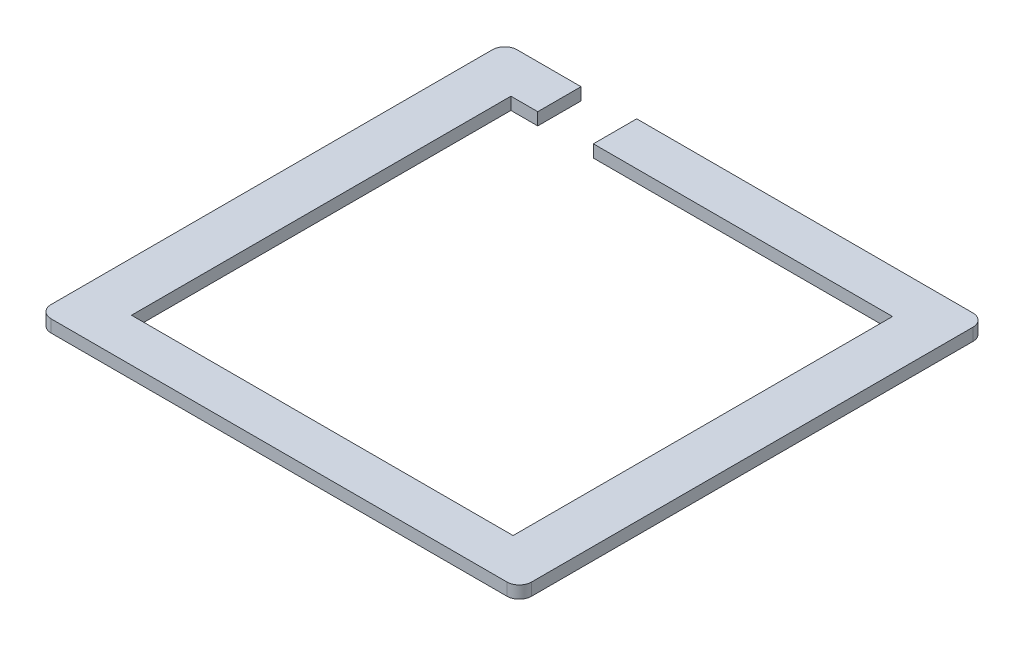
ISO-10303-21;
HEADER;
FILE_DESCRIPTION(('STEP AP214'),'2;1');
FILE_NAME('part.step','',(''),(''),'','','');
FILE_SCHEMA(('AUTOMOTIVE_DESIGN { 1 0 10303 214 1 1 1 1 }'));
ENDSEC;
DATA;
#1=APPLICATION_CONTEXT('core data for automotive mechanical design processes');
#2=APPLICATION_PROTOCOL_DEFINITION('international standard','automotive_design',2000,#1);
#3=PRODUCT_CONTEXT('',#1,'mechanical');
#4=PRODUCT('Part','Part','',(#3));
#5=PRODUCT_RELATED_PRODUCT_CATEGORY('part','',(#4));
#6=PRODUCT_DEFINITION_FORMATION('','',#4);
#7=PRODUCT_DEFINITION_CONTEXT('part definition',#1,'design');
#8=PRODUCT_DEFINITION('design','',#6,#7);
#9=PRODUCT_DEFINITION_SHAPE('','',#8);
#10=(LENGTH_UNIT() NAMED_UNIT(*) SI_UNIT(.MILLI.,.METRE.));
#11=(NAMED_UNIT(*) PLANE_ANGLE_UNIT() SI_UNIT($,.RADIAN.));
#12=(NAMED_UNIT(*) SI_UNIT($,.STERADIAN.) SOLID_ANGLE_UNIT());
#13=UNCERTAINTY_MEASURE_WITH_UNIT(LENGTH_MEASURE(1.E-05),#10,'distance_accuracy_value','');
#14=(GEOMETRIC_REPRESENTATION_CONTEXT(3) GLOBAL_UNCERTAINTY_ASSIGNED_CONTEXT((#13)) GLOBAL_UNIT_ASSIGNED_CONTEXT((#10,
#11,#12)) REPRESENTATION_CONTEXT('',''));
#15=CARTESIAN_POINT('',(0.,0.,0.));
#16=DIRECTION('',(0.,0.,1.));
#17=DIRECTION('',(1.,0.,0.));
#18=AXIS2_PLACEMENT_3D('',#15,#16,#17);
#19=CARTESIAN_POINT('',(-230.623168849227,-3016.47318900647,-84.0224827547028));
#20=DIRECTION('',(0.,0.,1.));
#21=DIRECTION('',(1.,0.,0.));
#22=AXIS2_PLACEMENT_3D('',#19,#20,#21);
#23=PLANE('',#22);
#24=DIRECTION('',(-1.,0.,0.));
#25=VECTOR('',#24,1.);
#26=CARTESIAN_POINT('',(-230.623168849227,-3016.47318900647,-84.0224827547028));
#27=LINE('',#26,#25);
#28=CARTESIAN_POINT('',(-220.284101987997,-3016.47318900647,-84.0224827547028));
#29=VERTEX_POINT('',#28);
#30=CARTESIAN_POINT('',(-230.623168849227,-3016.47318900647,-84.0224827547028));
#31=VERTEX_POINT('',#30);
#32=EDGE_CURVE('E190',#29,#31,#27,.T.);
#33=ORIENTED_EDGE('',*,*,#32,.F.);
#34=DIRECTION('',(0.,1.,0.));
#35=VECTOR('',#34,1.);
#36=CARTESIAN_POINT('',(-220.284101987997,-3018.47318900647,-84.0224827547028));
#37=LINE('',#36,#35);
#38=CARTESIAN_POINT('',(-220.284101987997,-3018.47318900647,-84.0224827547028));
#39=VERTEX_POINT('',#38);
#40=EDGE_CURVE('E263',#39,#29,#37,.T.);
#41=ORIENTED_EDGE('',*,*,#40,.F.);
#42=DIRECTION('',(-1.,0.,0.));
#43=VECTOR('',#42,1.);
#44=CARTESIAN_POINT('',(-230.623168849227,-3018.47318900647,-84.0224827547028));
#45=LINE('',#44,#43);
#46=CARTESIAN_POINT('',(-230.623168849227,-3018.47318900647,-84.0224827547028));
#47=VERTEX_POINT('',#46);
#48=EDGE_CURVE('E160',#39,#47,#45,.T.);
#49=ORIENTED_EDGE('',*,*,#48,.T.);
#50=DIRECTION('',(0.,-1.,0.));
#51=VECTOR('',#50,1.);
#52=CARTESIAN_POINT('',(-230.623168849227,-3016.47318900647,-84.0224827547028));
#53=LINE('',#52,#51);
#54=EDGE_CURVE('E41',#31,#47,#53,.T.);
#55=ORIENTED_EDGE('',*,*,#54,.F.);
#56=EDGE_LOOP('',(#33,#41,#49,#55));
#57=FACE_BOUND('',#56,.T.);
#58=ADVANCED_FACE('F33',(#57),#23,.F.);
#59=CARTESIAN_POINT('',(-224.623168849227,-3016.47318900647,-77.0224827547028));
#60=DIRECTION('',(0.,0.,1.));
#61=DIRECTION('',(1.,0.,0.));
#62=AXIS2_PLACEMENT_3D('',#59,#60,#61);
#63=PLANE('',#62);
#64=DIRECTION('',(0.,1.,0.));
#65=VECTOR('',#64,1.);
#66=CARTESIAN_POINT('',(-220.284101987998,-3018.47318900647,-77.0224827547028));
#67=LINE('',#66,#65);
#68=CARTESIAN_POINT('',(-220.284101987998,-3018.47318900647,-77.0224827547028));
#69=VERTEX_POINT('',#68);
#70=CARTESIAN_POINT('',(-220.284101987998,-3016.47318900647,-77.0224827547028));
#71=VERTEX_POINT('',#70);
#72=EDGE_CURVE('E143',#69,#71,#67,.T.);
#73=ORIENTED_EDGE('',*,*,#72,.T.);
#74=DIRECTION('',(-1.,0.,0.));
#75=VECTOR('',#74,1.);
#76=CARTESIAN_POINT('',(-224.623168849227,-3016.47318900647,-77.0224827547028));
#77=LINE('',#76,#75);
#78=CARTESIAN_POINT('',(-224.623168849227,-3016.47318900647,-77.0224827547028));
#79=VERTEX_POINT('',#78);
#80=EDGE_CURVE('E280',#71,#79,#77,.T.);
#81=ORIENTED_EDGE('',*,*,#80,.T.);
#82=DIRECTION('',(0.,-1.,0.));
#83=VECTOR('',#82,1.);
#84=CARTESIAN_POINT('',(-224.623168849227,-3016.47318900647,-77.0224827547028));
#85=LINE('',#84,#83);
#86=CARTESIAN_POINT('',(-224.623168849227,-3018.47318900647,-77.0224827547028));
#87=VERTEX_POINT('',#86);
#88=EDGE_CURVE('E166',#79,#87,#85,.T.);
#89=ORIENTED_EDGE('',*,*,#88,.T.);
#90=DIRECTION('',(-1.,0.,0.));
#91=VECTOR('',#90,1.);
#92=CARTESIAN_POINT('',(-224.623168849227,-3018.47318900647,-77.0224827547028));
#93=LINE('',#92,#91);
#94=EDGE_CURVE('E157',#69,#87,#93,.T.);
#95=ORIENTED_EDGE('',*,*,#94,.F.);
#96=EDGE_LOOP('',(#73,#81,#89,#95));
#97=FACE_BOUND('',#96,.T.);
#98=ADVANCED_FACE('F164',(#97),#63,.T.);
#99=CARTESIAN_POINT('',(-156.921026238005,-3016.47318900647,-82.0224827547028));
#100=DIRECTION('',(0.,-1.,0.));
#101=DIRECTION('',(0.,0.,-1.));
#102=AXIS2_PLACEMENT_3D('',#99,#100,#101);
#103=PLANE('',#102);
#104=ORIENTED_EDGE('',*,*,#80,.F.);
#105=DIRECTION('',(0.,0.,1.));
#106=VECTOR('',#105,1.);
#107=CARTESIAN_POINT('',(-220.284101987997,-3016.47318900647,-84.0224827547028));
#108=LINE('',#107,#106);
#109=EDGE_CURVE('E48',#29,#71,#108,.T.);
#110=ORIENTED_EDGE('',*,*,#109,.F.);
#111=ORIENTED_EDGE('',*,*,#32,.T.);
#112=CARTESIAN_POINT('',(-230.623168849227,-3016.47318900647,-82.0224827547028));
#113=DIRECTION('',(0.,1.,0.));
#114=DIRECTION('',(0.,0.,-1.));
#115=AXIS2_PLACEMENT_3D('',#112,#113,#114);
#116=CIRCLE('',#115,2.);
#117=CARTESIAN_POINT('',(-232.623168849227,-3016.47318900647,-82.0224827547028));
#118=VERTEX_POINT('',#117);
#119=EDGE_CURVE('E195',#31,#118,#116,.T.);
#120=ORIENTED_EDGE('',*,*,#119,.T.);
#121=DIRECTION('',(0.,0.,1.));
#122=VECTOR('',#121,1.);
#123=CARTESIAN_POINT('',(-232.623168849227,-3016.47318900647,-82.0224827547028));
#124=LINE('',#123,#122);
#125=CARTESIAN_POINT('',(-232.623168849227,-3016.47318900647,-10.6752428557218));
#126=VERTEX_POINT('',#125);
#127=EDGE_CURVE('E197',#118,#126,#124,.T.);
#128=ORIENTED_EDGE('',*,*,#127,.T.);
#129=CARTESIAN_POINT('',(-230.623168849227,-3016.47318900647,-10.6752428557218));
#130=DIRECTION('',(0.,1.,0.));
#131=DIRECTION('',(0.,0.,-1.));
#132=AXIS2_PLACEMENT_3D('',#129,#130,#131);
#133=CIRCLE('',#132,1.99999999999999);
#134=CARTESIAN_POINT('',(-230.623168849227,-3016.47318900647,-8.67524285572184));
#135=VERTEX_POINT('',#134);
#136=EDGE_CURVE('E199',#126,#135,#133,.T.);
#137=ORIENTED_EDGE('',*,*,#136,.T.);
#138=DIRECTION('',(1.,0.,0.));
#139=VECTOR('',#138,1.);
#140=CARTESIAN_POINT('',(-230.623168849227,-3016.47318900647,-8.67524285572183));
#141=LINE('',#140,#139);
#142=CARTESIAN_POINT('',(-156.921026238005,-3016.47318900647,-8.67524285572183));
#143=VERTEX_POINT('',#142);
#144=EDGE_CURVE('E201',#135,#143,#141,.T.);
#145=ORIENTED_EDGE('',*,*,#144,.T.);
#146=CARTESIAN_POINT('',(-156.921026238005,-3016.47318900647,-10.6752428557218));
#147=DIRECTION('',(0.,1.,0.));
#148=DIRECTION('',(0.,0.,-1.));
#149=AXIS2_PLACEMENT_3D('',#146,#147,#148);
#150=CIRCLE('',#149,1.99999999999999);
#151=CARTESIAN_POINT('',(-154.921026238005,-3016.47318900647,-10.6752428557218));
#152=VERTEX_POINT('',#151);
#153=EDGE_CURVE('E203',#143,#152,#150,.T.);
#154=ORIENTED_EDGE('',*,*,#153,.T.);
#155=DIRECTION('',(0.,0.,-1.));
#156=VECTOR('',#155,1.);
#157=CARTESIAN_POINT('',(-154.921026238005,-3016.47318900647,-82.0224827547028));
#158=LINE('',#157,#156);
#159=CARTESIAN_POINT('',(-154.921026238005,-3016.47318900647,-82.0224827547028));
#160=VERTEX_POINT('',#159);
#161=EDGE_CURVE('E205',#152,#160,#158,.T.);
#162=ORIENTED_EDGE('',*,*,#161,.T.);
#163=CARTESIAN_POINT('',(-156.921026238005,-3016.47318900647,-82.0224827547028));
#164=DIRECTION('',(0.,1.,0.));
#165=DIRECTION('',(0.,0.,-1.));
#166=AXIS2_PLACEMENT_3D('',#163,#164,#165);
#167=CIRCLE('',#166,2.);
#168=CARTESIAN_POINT('',(-156.921026238005,-3016.47318900647,-84.0224827547028));
#169=VERTEX_POINT('',#168);
#170=EDGE_CURVE('E187',#160,#169,#167,.T.);
#171=ORIENTED_EDGE('',*,*,#170,.T.);
#172=CARTESIAN_POINT('',(-211.284101987998,-3016.47318900647,-84.0224827547028));
#173=VERTEX_POINT('',#172);
#174=EDGE_CURVE('E192',#169,#173,#27,.T.);
#175=ORIENTED_EDGE('',*,*,#174,.T.);
#176=DIRECTION('',(0.,0.,-1.));
#177=VECTOR('',#176,1.);
#178=CARTESIAN_POINT('',(-211.284101987998,-3016.47318900647,-84.0224827547028));
#179=LINE('',#178,#177);
#180=CARTESIAN_POINT('',(-211.284101987998,-3016.47318900647,-77.0224827547028));
#181=VERTEX_POINT('',#180);
#182=EDGE_CURVE('E161',#181,#173,#179,.T.);
#183=ORIENTED_EDGE('',*,*,#182,.F.);
#184=CARTESIAN_POINT('',(-162.921026238005,-3016.47318900647,-77.0224827547028));
#185=VERTEX_POINT('',#184);
#186=EDGE_CURVE('E179',#185,#181,#77,.T.);
#187=ORIENTED_EDGE('',*,*,#186,.F.);
#188=DIRECTION('',(0.,0.,-1.));
#189=VECTOR('',#188,1.);
#190=CARTESIAN_POINT('',(-162.921026238005,-3016.47318900647,-77.0224827547028));
#191=LINE('',#190,#189);
#192=CARTESIAN_POINT('',(-162.921026238005,-3016.47318900647,-15.6752428557218));
#193=VERTEX_POINT('',#192);
#194=EDGE_CURVE('E277',#193,#185,#191,.T.);
#195=ORIENTED_EDGE('',*,*,#194,.F.);
#196=DIRECTION('',(1.,0.,0.));
#197=VECTOR('',#196,1.);
#198=CARTESIAN_POINT('',(-224.623168849227,-3016.47318900647,-15.6752428557218));
#199=LINE('',#198,#197);
#200=CARTESIAN_POINT('',(-224.623168849227,-3016.47318900647,-15.6752428557218));
#201=VERTEX_POINT('',#200);
#202=EDGE_CURVE('E275',#201,#193,#199,.T.);
#203=ORIENTED_EDGE('',*,*,#202,.F.);
#204=DIRECTION('',(0.,0.,1.));
#205=VECTOR('',#204,1.);
#206=CARTESIAN_POINT('',(-224.623168849227,-3016.47318900647,-77.0224827547028));
#207=LINE('',#206,#205);
#208=EDGE_CURVE('E171',#79,#201,#207,.T.);
#209=ORIENTED_EDGE('',*,*,#208,.F.);
#210=EDGE_LOOP('',(#104,#110,#111,#120,#128,#137,#145,#154,#162,#171,#175,#183,#187,#195,#203,#209));
#211=FACE_BOUND('',#210,.T.);
#212=ADVANCED_FACE('F261',(#211),#103,.F.);
#213=CARTESIAN_POINT('',(-156.921026238005,-3018.47318900647,-82.0224827547028));
#214=DIRECTION('',(0.,-1.,0.));
#215=DIRECTION('',(0.,0.,-1.));
#216=AXIS2_PLACEMENT_3D('',#213,#214,#215);
#217=PLANE('',#216);
#218=DIRECTION('',(0.,0.,1.));
#219=VECTOR('',#218,1.);
#220=CARTESIAN_POINT('',(-220.284101987997,-3018.47318900647,-84.0224827547028));
#221=LINE('',#220,#219);
#222=EDGE_CURVE('E146',#39,#69,#221,.T.);
#223=ORIENTED_EDGE('',*,*,#222,.T.);
#224=ORIENTED_EDGE('',*,*,#94,.T.);
#225=DIRECTION('',(0.,0.,1.));
#226=VECTOR('',#225,1.);
#227=CARTESIAN_POINT('',(-224.623168849227,-3018.47318900647,-77.0224827547028));
#228=LINE('',#227,#226);
#229=CARTESIAN_POINT('',(-224.623168849227,-3018.47318900647,-15.6752428557218));
#230=VERTEX_POINT('',#229);
#231=EDGE_CURVE('E264',#87,#230,#228,.T.);
#232=ORIENTED_EDGE('',*,*,#231,.T.);
#233=DIRECTION('',(1.,0.,0.));
#234=VECTOR('',#233,1.);
#235=CARTESIAN_POINT('',(-224.623168849227,-3018.47318900647,-15.6752428557218));
#236=LINE('',#235,#234);
#237=CARTESIAN_POINT('',(-162.921026238005,-3018.47318900647,-15.6752428557218));
#238=VERTEX_POINT('',#237);
#239=EDGE_CURVE('E173',#230,#238,#236,.T.);
#240=ORIENTED_EDGE('',*,*,#239,.T.);
#241=DIRECTION('',(0.,0.,-1.));
#242=VECTOR('',#241,1.);
#243=CARTESIAN_POINT('',(-162.921026238005,-3018.47318900647,-77.0224827547028));
#244=LINE('',#243,#242);
#245=CARTESIAN_POINT('',(-162.921026238005,-3018.47318900647,-77.0224827547028));
#246=VERTEX_POINT('',#245);
#247=EDGE_CURVE('E168',#238,#246,#244,.T.);
#248=ORIENTED_EDGE('',*,*,#247,.T.);
#249=CARTESIAN_POINT('',(-211.284101987998,-3018.47318900647,-77.0224827547028));
#250=VERTEX_POINT('',#249);
#251=EDGE_CURVE('E167',#246,#250,#93,.T.);
#252=ORIENTED_EDGE('',*,*,#251,.T.);
#253=DIRECTION('',(0.,0.,-1.));
#254=VECTOR('',#253,1.);
#255=CARTESIAN_POINT('',(-211.284101987998,-3018.47318900647,-84.0224827547028));
#256=LINE('',#255,#254);
#257=CARTESIAN_POINT('',(-211.284101987998,-3018.47318900647,-84.0224827547028));
#258=VERTEX_POINT('',#257);
#259=EDGE_CURVE('E56',#250,#258,#256,.T.);
#260=ORIENTED_EDGE('',*,*,#259,.T.);
#261=CARTESIAN_POINT('',(-156.921026238005,-3018.47318900647,-84.0224827547028));
#262=VERTEX_POINT('',#261);
#263=EDGE_CURVE('E210',#262,#258,#45,.T.);
#264=ORIENTED_EDGE('',*,*,#263,.F.);
#265=CARTESIAN_POINT('',(-156.921026238005,-3018.47318900647,-82.0224827547028));
#266=DIRECTION('',(0.,1.,0.));
#267=DIRECTION('',(0.,0.,-1.));
#268=AXIS2_PLACEMENT_3D('',#265,#266,#267);
#269=CIRCLE('',#268,2.);
#270=CARTESIAN_POINT('',(-154.921026238005,-3018.47318900647,-82.0224827547028));
#271=VERTEX_POINT('',#270);
#272=EDGE_CURVE('E186',#271,#262,#269,.T.);
#273=ORIENTED_EDGE('',*,*,#272,.F.);
#274=DIRECTION('',(0.,0.,-1.));
#275=VECTOR('',#274,1.);
#276=CARTESIAN_POINT('',(-154.921026238005,-3018.47318900647,-82.0224827547028));
#277=LINE('',#276,#275);
#278=CARTESIAN_POINT('',(-154.921026238005,-3018.47318900647,-10.6752428557218));
#279=VERTEX_POINT('',#278);
#280=EDGE_CURVE('E191',#279,#271,#277,.T.);
#281=ORIENTED_EDGE('',*,*,#280,.F.);
#282=CARTESIAN_POINT('',(-156.921026238005,-3018.47318900647,-10.6752428557218));
#283=DIRECTION('',(0.,1.,0.));
#284=DIRECTION('',(0.,0.,-1.));
#285=AXIS2_PLACEMENT_3D('',#282,#283,#284);
#286=CIRCLE('',#285,1.99999999999999);
#287=CARTESIAN_POINT('',(-156.921026238005,-3018.47318900647,-8.67524285572183));
#288=VERTEX_POINT('',#287);
#289=EDGE_CURVE('E221',#288,#279,#286,.T.);
#290=ORIENTED_EDGE('',*,*,#289,.F.);
#291=DIRECTION('',(1.,0.,0.));
#292=VECTOR('',#291,1.);
#293=CARTESIAN_POINT('',(-230.623168849227,-3018.47318900647,-8.67524285572183));
#294=LINE('',#293,#292);
#295=CARTESIAN_POINT('',(-230.623168849227,-3018.47318900647,-8.67524285572184));
#296=VERTEX_POINT('',#295);
#297=EDGE_CURVE('E219',#296,#288,#294,.T.);
#298=ORIENTED_EDGE('',*,*,#297,.F.);
#299=CARTESIAN_POINT('',(-230.623168849227,-3018.47318900647,-10.6752428557218));
#300=DIRECTION('',(0.,1.,0.));
#301=DIRECTION('',(0.,0.,-1.));
#302=AXIS2_PLACEMENT_3D('',#299,#300,#301);
#303=CIRCLE('',#302,1.99999999999999);
#304=CARTESIAN_POINT('',(-232.623168849227,-3018.47318900647,-10.6752428557218));
#305=VERTEX_POINT('',#304);
#306=EDGE_CURVE('E217',#305,#296,#303,.T.);
#307=ORIENTED_EDGE('',*,*,#306,.F.);
#308=DIRECTION('',(0.,0.,1.));
#309=VECTOR('',#308,1.);
#310=CARTESIAN_POINT('',(-232.623168849227,-3018.47318900647,-82.0224827547028));
#311=LINE('',#310,#309);
#312=CARTESIAN_POINT('',(-232.623168849227,-3018.47318900647,-82.0224827547028));
#313=VERTEX_POINT('',#312);
#314=EDGE_CURVE('E215',#313,#305,#311,.T.);
#315=ORIENTED_EDGE('',*,*,#314,.F.);
#316=CARTESIAN_POINT('',(-230.623168849227,-3018.47318900647,-82.0224827547028));
#317=DIRECTION('',(0.,1.,0.));
#318=DIRECTION('',(0.,0.,-1.));
#319=AXIS2_PLACEMENT_3D('',#316,#317,#318);
#320=CIRCLE('',#319,2.);
#321=EDGE_CURVE('E213',#47,#313,#320,.T.);
#322=ORIENTED_EDGE('',*,*,#321,.F.);
#323=ORIENTED_EDGE('',*,*,#48,.F.);
#324=EDGE_LOOP('',(#223,#224,#232,#240,#248,#252,#260,#264,#273,#281,#290,#298,#307,#315,#322,#323));
#325=FACE_BOUND('',#324,.T.);
#326=ADVANCED_FACE('F155',(#325),#217,.T.);
#327=CARTESIAN_POINT('',(-156.921026238005,-3016.47318900647,-82.0224827547028));
#328=DIRECTION('',(0.,-1.,0.));
#329=DIRECTION('',(0.,0.,-1.));
#330=AXIS2_PLACEMENT_3D('',#327,#328,#329);
#331=CYLINDRICAL_SURFACE('',#330,2.);
#332=ORIENTED_EDGE('',*,*,#272,.T.);
#333=DIRECTION('',(0.,-1.,0.));
#334=VECTOR('',#333,1.);
#335=CARTESIAN_POINT('',(-156.921026238005,-3016.47318900647,-84.0224827547028));
#336=LINE('',#335,#334);
#337=EDGE_CURVE('E11',#169,#262,#336,.T.);
#338=ORIENTED_EDGE('',*,*,#337,.F.);
#339=ORIENTED_EDGE('',*,*,#170,.F.);
#340=DIRECTION('',(0.,-1.,0.));
#341=VECTOR('',#340,1.);
#342=CARTESIAN_POINT('',(-154.921026238005,-3016.47318900647,-82.0224827547028));
#343=LINE('',#342,#341);
#344=EDGE_CURVE('E207',#160,#271,#343,.T.);
#345=ORIENTED_EDGE('',*,*,#344,.T.);
#346=EDGE_LOOP('',(#332,#338,#339,#345));
#347=FACE_BOUND('',#346,.T.);
#348=ADVANCED_FACE('F35',(#347),#331,.T.);
#349=ORIENTED_EDGE('',*,*,#263,.T.);
#350=DIRECTION('',(0.,1.,0.));
#351=VECTOR('',#350,1.);
#352=CARTESIAN_POINT('',(-211.284101987998,-3018.47318900647,-84.0224827547028));
#353=LINE('',#352,#351);
#354=EDGE_CURVE('E265',#258,#173,#353,.T.);
#355=ORIENTED_EDGE('',*,*,#354,.T.);
#356=ORIENTED_EDGE('',*,*,#174,.F.);
#357=ORIENTED_EDGE('',*,*,#337,.T.);
#358=EDGE_LOOP('',(#349,#355,#356,#357));
#359=FACE_BOUND('',#358,.T.);
#360=ADVANCED_FACE('F302',(#359),#23,.F.);
#361=CARTESIAN_POINT('',(-230.623168849227,-3016.47318900647,-82.0224827547028));
#362=DIRECTION('',(0.,-1.,0.));
#363=DIRECTION('',(0.,0.,-1.));
#364=AXIS2_PLACEMENT_3D('',#361,#362,#363);
#365=CYLINDRICAL_SURFACE('',#364,2.);
#366=ORIENTED_EDGE('',*,*,#321,.T.);
#367=DIRECTION('',(0.,-1.,0.));
#368=VECTOR('',#367,1.);
#369=CARTESIAN_POINT('',(-232.623168849227,-3016.47318900647,-82.0224827547028));
#370=LINE('',#369,#368);
#371=EDGE_CURVE('E238',#118,#313,#370,.T.);
#372=ORIENTED_EDGE('',*,*,#371,.F.);
#373=ORIENTED_EDGE('',*,*,#119,.F.);
#374=ORIENTED_EDGE('',*,*,#54,.T.);
#375=EDGE_LOOP('',(#366,#372,#373,#374));
#376=FACE_BOUND('',#375,.T.);
#377=ADVANCED_FACE('F244',(#376),#365,.T.);
#378=CARTESIAN_POINT('',(-232.623168849227,-3016.47318900647,-82.0224827547028));
#379=DIRECTION('',(1.,0.,0.));
#380=DIRECTION('',(0.,0.,-1.));
#381=AXIS2_PLACEMENT_3D('',#378,#379,#380);
#382=PLANE('',#381);
#383=ORIENTED_EDGE('',*,*,#314,.T.);
#384=DIRECTION('',(0.,-1.,0.));
#385=VECTOR('',#384,1.);
#386=CARTESIAN_POINT('',(-232.623168849227,-3016.47318900647,-10.6752428557218));
#387=LINE('',#386,#385);
#388=EDGE_CURVE('E235',#126,#305,#387,.T.);
#389=ORIENTED_EDGE('',*,*,#388,.F.);
#390=ORIENTED_EDGE('',*,*,#127,.F.);
#391=ORIENTED_EDGE('',*,*,#371,.T.);
#392=EDGE_LOOP('',(#383,#389,#390,#391));
#393=FACE_BOUND('',#392,.T.);
#394=ADVANCED_FACE('F253',(#393),#382,.F.);
#395=CARTESIAN_POINT('',(-230.623168849227,-3016.47318900647,-10.6752428557218));
#396=DIRECTION('',(0.,-1.,0.));
#397=DIRECTION('',(0.,0.,-1.));
#398=AXIS2_PLACEMENT_3D('',#395,#396,#397);
#399=CYLINDRICAL_SURFACE('',#398,1.99999999999999);
#400=ORIENTED_EDGE('',*,*,#306,.T.);
#401=DIRECTION('',(0.,-1.,0.));
#402=VECTOR('',#401,1.);
#403=CARTESIAN_POINT('',(-230.623168849227,-3016.47318900647,-8.67524285572184));
#404=LINE('',#403,#402);
#405=EDGE_CURVE('E232',#135,#296,#404,.T.);
#406=ORIENTED_EDGE('',*,*,#405,.F.);
#407=ORIENTED_EDGE('',*,*,#136,.F.);
#408=ORIENTED_EDGE('',*,*,#388,.T.);
#409=EDGE_LOOP('',(#400,#406,#407,#408));
#410=FACE_BOUND('',#409,.T.);
#411=ADVANCED_FACE('F257',(#410),#399,.T.);
#412=CARTESIAN_POINT('',(-230.623168849227,-3016.47318900647,-8.67524285572183));
#413=DIRECTION('',(0.,0.,-1.));
#414=DIRECTION('',(-1.,0.,0.));
#415=AXIS2_PLACEMENT_3D('',#412,#413,#414);
#416=PLANE('',#415);
#417=ORIENTED_EDGE('',*,*,#297,.T.);
#418=DIRECTION('',(0.,-1.,0.));
#419=VECTOR('',#418,1.);
#420=CARTESIAN_POINT('',(-156.921026238005,-3016.47318900647,-8.67524285572183));
#421=LINE('',#420,#419);
#422=EDGE_CURVE('E229',#143,#288,#421,.T.);
#423=ORIENTED_EDGE('',*,*,#422,.F.);
#424=ORIENTED_EDGE('',*,*,#144,.F.);
#425=ORIENTED_EDGE('',*,*,#405,.T.);
#426=EDGE_LOOP('',(#417,#423,#424,#425));
#427=FACE_BOUND('',#426,.T.);
#428=ADVANCED_FACE('F317',(#427),#416,.F.);
#429=CARTESIAN_POINT('',(-156.921026238005,-3016.47318900647,-10.6752428557218));
#430=DIRECTION('',(0.,-1.,0.));
#431=DIRECTION('',(0.,0.,-1.));
#432=AXIS2_PLACEMENT_3D('',#429,#430,#431);
#433=CYLINDRICAL_SURFACE('',#432,1.99999999999999);
#434=ORIENTED_EDGE('',*,*,#289,.T.);
#435=DIRECTION('',(0.,-1.,0.));
#436=VECTOR('',#435,1.);
#437=CARTESIAN_POINT('',(-154.921026238005,-3016.47318900647,-10.6752428557218));
#438=LINE('',#437,#436);
#439=EDGE_CURVE('E226',#152,#279,#438,.T.);
#440=ORIENTED_EDGE('',*,*,#439,.F.);
#441=ORIENTED_EDGE('',*,*,#153,.F.);
#442=ORIENTED_EDGE('',*,*,#422,.T.);
#443=EDGE_LOOP('',(#434,#440,#441,#442));
#444=FACE_BOUND('',#443,.T.);
#445=ADVANCED_FACE('F315',(#444),#433,.T.);
#446=CARTESIAN_POINT('',(-154.921026238005,-3016.47318900647,-82.0224827547028));
#447=DIRECTION('',(-1.,0.,0.));
#448=DIRECTION('',(0.,0.,1.));
#449=AXIS2_PLACEMENT_3D('',#446,#447,#448);
#450=PLANE('',#449);
#451=ORIENTED_EDGE('',*,*,#280,.T.);
#452=ORIENTED_EDGE('',*,*,#344,.F.);
#453=ORIENTED_EDGE('',*,*,#161,.F.);
#454=ORIENTED_EDGE('',*,*,#439,.T.);
#455=EDGE_LOOP('',(#451,#452,#453,#454));
#456=FACE_BOUND('',#455,.T.);
#457=ADVANCED_FACE('F310',(#456),#450,.F.);
#458=CARTESIAN_POINT('',(-224.623168849227,-3016.47318900647,-77.0224827547028));
#459=DIRECTION('',(1.,0.,0.));
#460=DIRECTION('',(0.,0.,-1.));
#461=AXIS2_PLACEMENT_3D('',#458,#459,#460);
#462=PLANE('',#461);
#463=ORIENTED_EDGE('',*,*,#231,.F.);
#464=ORIENTED_EDGE('',*,*,#88,.F.);
#465=ORIENTED_EDGE('',*,*,#208,.T.);
#466=DIRECTION('',(0.,-1.,0.));
#467=VECTOR('',#466,1.);
#468=CARTESIAN_POINT('',(-224.623168849227,-3016.47318900647,-15.6752428557218));
#469=LINE('',#468,#467);
#470=EDGE_CURVE('E183',#201,#230,#469,.T.);
#471=ORIENTED_EDGE('',*,*,#470,.T.);
#472=EDGE_LOOP('',(#463,#464,#465,#471));
#473=FACE_BOUND('',#472,.T.);
#474=ADVANCED_FACE('F290',(#473),#462,.T.);
#475=CARTESIAN_POINT('',(-224.623168849227,-3016.47318900647,-15.6752428557218));
#476=DIRECTION('',(0.,0.,-1.));
#477=DIRECTION('',(-1.,0.,0.));
#478=AXIS2_PLACEMENT_3D('',#475,#476,#477);
#479=PLANE('',#478);
#480=ORIENTED_EDGE('',*,*,#239,.F.);
#481=ORIENTED_EDGE('',*,*,#470,.F.);
#482=ORIENTED_EDGE('',*,*,#202,.T.);
#483=DIRECTION('',(0.,-1.,0.));
#484=VECTOR('',#483,1.);
#485=CARTESIAN_POINT('',(-162.921026238005,-3016.47318900647,-15.6752428557218));
#486=LINE('',#485,#484);
#487=EDGE_CURVE('E181',#193,#238,#486,.T.);
#488=ORIENTED_EDGE('',*,*,#487,.T.);
#489=EDGE_LOOP('',(#480,#481,#482,#488));
#490=FACE_BOUND('',#489,.T.);
#491=ADVANCED_FACE('F286',(#490),#479,.T.);
#492=CARTESIAN_POINT('',(-162.921026238005,-3016.47318900647,-77.0224827547028));
#493=DIRECTION('',(-1.,0.,0.));
#494=DIRECTION('',(0.,0.,1.));
#495=AXIS2_PLACEMENT_3D('',#492,#493,#494);
#496=PLANE('',#495);
#497=ORIENTED_EDGE('',*,*,#247,.F.);
#498=ORIENTED_EDGE('',*,*,#487,.F.);
#499=ORIENTED_EDGE('',*,*,#194,.T.);
#500=DIRECTION('',(0.,-1.,0.));
#501=VECTOR('',#500,1.);
#502=CARTESIAN_POINT('',(-162.921026238005,-3016.47318900647,-77.0224827547028));
#503=LINE('',#502,#501);
#504=EDGE_CURVE('E178',#185,#246,#503,.T.);
#505=ORIENTED_EDGE('',*,*,#504,.T.);
#506=EDGE_LOOP('',(#497,#498,#499,#505));
#507=FACE_BOUND('',#506,.T.);
#508=ADVANCED_FACE('F295',(#507),#496,.T.);
#509=DIRECTION('',(0.,1.,0.));
#510=VECTOR('',#509,1.);
#511=CARTESIAN_POINT('',(-211.284101987998,-3018.47318900647,-77.0224827547028));
#512=LINE('',#511,#510);
#513=EDGE_CURVE('E151',#250,#181,#512,.T.);
#514=ORIENTED_EDGE('',*,*,#513,.F.);
#515=ORIENTED_EDGE('',*,*,#251,.F.);
#516=ORIENTED_EDGE('',*,*,#504,.F.);
#517=ORIENTED_EDGE('',*,*,#186,.T.);
#518=EDGE_LOOP('',(#514,#515,#516,#517));
#519=FACE_BOUND('',#518,.T.);
#520=ADVANCED_FACE('F298',(#519),#63,.T.);
#521=CARTESIAN_POINT('',(-211.284101987998,-3018.47318900647,-84.0224827547028));
#522=DIRECTION('',(1.,0.,0.));
#523=DIRECTION('',(0.,0.,-1.));
#524=AXIS2_PLACEMENT_3D('',#521,#522,#523);
#525=PLANE('',#524);
#526=ORIENTED_EDGE('',*,*,#182,.T.);
#527=ORIENTED_EDGE('',*,*,#354,.F.);
#528=ORIENTED_EDGE('',*,*,#259,.F.);
#529=ORIENTED_EDGE('',*,*,#513,.T.);
#530=EDGE_LOOP('',(#526,#527,#528,#529));
#531=FACE_BOUND('',#530,.T.);
#532=ADVANCED_FACE('F359',(#531),#525,.F.);
#533=CARTESIAN_POINT('',(-220.284101987997,-3018.47318900647,-84.0224827547028));
#534=DIRECTION('',(-1.,0.,0.));
#535=DIRECTION('',(0.,0.,1.));
#536=AXIS2_PLACEMENT_3D('',#533,#534,#535);
#537=PLANE('',#536);
#538=ORIENTED_EDGE('',*,*,#109,.T.);
#539=ORIENTED_EDGE('',*,*,#72,.F.);
#540=ORIENTED_EDGE('',*,*,#222,.F.);
#541=ORIENTED_EDGE('',*,*,#40,.T.);
#542=EDGE_LOOP('',(#538,#539,#540,#541));
#543=FACE_BOUND('',#542,.T.);
#544=ADVANCED_FACE('F145',(#543),#537,.F.);
#545=CLOSED_SHELL('',(#58,#98,#212,#326,#348,#360,#377,#394,#411,#428,#445,#457,#474,#491,#508,
#520,#532,#544));
#546=MANIFOLD_SOLID_BREP('B2',#545);
#547=ADVANCED_BREP_SHAPE_REPRESENTATION('',(#18,#546),#14);
#548=SHAPE_DEFINITION_REPRESENTATION(#9,#547);
ENDSEC;
END-ISO-10303-21;
